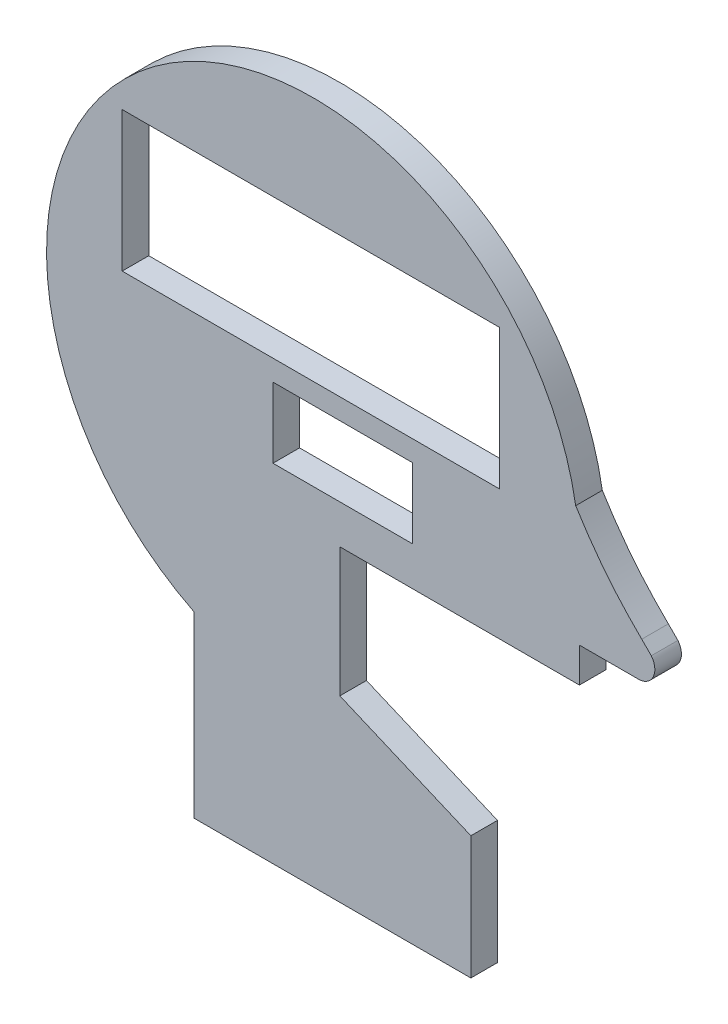
ISO-10303-21;
HEADER;
FILE_DESCRIPTION(('STEP AP214'),'2;1');
FILE_NAME('part.step','',(''),(''),'','','');
FILE_SCHEMA(('AUTOMOTIVE_DESIGN { 1 0 10303 214 1 1 1 1 }'));
ENDSEC;
DATA;
#1=APPLICATION_CONTEXT('core data for automotive mechanical design processes');
#2=APPLICATION_PROTOCOL_DEFINITION('international standard','automotive_design',2000,#1);
#3=PRODUCT_CONTEXT('',#1,'mechanical');
#4=PRODUCT('Part','Part','',(#3));
#5=PRODUCT_RELATED_PRODUCT_CATEGORY('part','',(#4));
#6=PRODUCT_DEFINITION_FORMATION('','',#4);
#7=PRODUCT_DEFINITION_CONTEXT('part definition',#1,'design');
#8=PRODUCT_DEFINITION('design','',#6,#7);
#9=PRODUCT_DEFINITION_SHAPE('','',#8);
#10=(LENGTH_UNIT() NAMED_UNIT(*) SI_UNIT(.MILLI.,.METRE.));
#11=(NAMED_UNIT(*) PLANE_ANGLE_UNIT() SI_UNIT($,.RADIAN.));
#12=(NAMED_UNIT(*) SI_UNIT($,.STERADIAN.) SOLID_ANGLE_UNIT());
#13=UNCERTAINTY_MEASURE_WITH_UNIT(LENGTH_MEASURE(1.E-05),#10,'distance_accuracy_value','');
#14=(GEOMETRIC_REPRESENTATION_CONTEXT(3) GLOBAL_UNCERTAINTY_ASSIGNED_CONTEXT((#13)) GLOBAL_UNIT_ASSIGNED_CONTEXT((#10,
#11,#12)) REPRESENTATION_CONTEXT('',''));
#15=CARTESIAN_POINT('',(0.,0.,0.));
#16=DIRECTION('',(0.,0.,1.));
#17=DIRECTION('',(1.,0.,0.));
#18=AXIS2_PLACEMENT_3D('',#15,#16,#17);
#19=CARTESIAN_POINT('',(75.2526666653318,12.6991314866566,7.62));
#20=CARTESIAN_POINT('',(83.2682176563842,-0.404579697613995,7.62));
#21=CARTESIAN_POINT('',(94.1739478198759,-10.9638502208492,7.62));
#22=B_SPLINE_CURVE_WITH_KNOTS('',2,(#19,#20,#21),.UNSPECIFIED.,.F.,.F.,(3,3),(0.,1.),.UNSPECIFIED.);
#23=DIRECTION('',(0.,0.,-1.));
#24=VECTOR('',#23,1.);
#25=SURFACE_OF_LINEAR_EXTRUSION('',#22,#24);
#26=CARTESIAN_POINT('',(75.2526666653318,12.6991314866566,0.));
#27=CARTESIAN_POINT('',(83.2682176563842,-0.404579697613995,0.));
#28=CARTESIAN_POINT('',(94.1739478198759,-10.9638502208492,0.));
#29=B_SPLINE_CURVE_WITH_KNOTS('',2,(#26,#27,#28),.UNSPECIFIED.,.F.,.F.,(3,3),(0.,1.),.UNSPECIFIED.);
#30=CARTESIAN_POINT('',(75.2526666653318,12.6991314866566,0.));
#31=VERTEX_POINT('',#30);
#32=CARTESIAN_POINT('',(94.1739478198759,-10.9638502208492,0.));
#33=VERTEX_POINT('',#32);
#34=EDGE_CURVE('E207',#31,#33,#29,.T.);
#35=ORIENTED_EDGE('',*,*,#34,.F.);
#36=DIRECTION('',(0.,0.,-1.));
#37=VECTOR('',#36,1.);
#38=CARTESIAN_POINT('',(75.2526666653318,12.6991314866566,7.62));
#39=LINE('',#38,#37);
#40=CARTESIAN_POINT('',(75.2526666653318,12.6991314866566,7.62));
#41=VERTEX_POINT('',#40);
#42=EDGE_CURVE('E11',#41,#31,#39,.T.);
#43=ORIENTED_EDGE('',*,*,#42,.F.);
#44=CARTESIAN_POINT('',(94.1739478198759,-10.9638502208492,7.62));
#45=VERTEX_POINT('',#44);
#46=EDGE_CURVE('E239',#41,#45,#22,.T.);
#47=ORIENTED_EDGE('',*,*,#46,.T.);
#48=DIRECTION('',(0.,0.,-1.));
#49=VECTOR('',#48,1.);
#50=CARTESIAN_POINT('',(94.1739478198759,-10.9638502208492,7.62));
#51=LINE('',#50,#49);
#52=EDGE_CURVE('E275',#45,#33,#51,.T.);
#53=ORIENTED_EDGE('',*,*,#52,.T.);
#54=EDGE_LOOP('',(#35,#43,#47,#53));
#55=FACE_BOUND('',#54,.T.);
#56=ADVANCED_FACE('F34',(#55),#25,.T.);
#57=CARTESIAN_POINT('',(0.,0.,7.62));
#58=DIRECTION('',(0.,0.,-1.));
#59=DIRECTION('',(-1.,0.,0.));
#60=AXIS2_PLACEMENT_3D('',#57,#58,#59);
#61=CYLINDRICAL_SURFACE('',#60,76.316654674841);
#62=CARTESIAN_POINT('',(0.,0.,0.));
#63=DIRECTION('',(0.,0.,1.));
#64=DIRECTION('',(1.,0.,0.));
#65=AXIS2_PLACEMENT_3D('',#62,#63,#64);
#66=CIRCLE('',#65,76.316654674841);
#67=CARTESIAN_POINT('',(-34.1298455336643,-68.2596910673286,0.));
#68=VERTEX_POINT('',#67);
#69=EDGE_CURVE('E280',#31,#68,#66,.T.);
#70=ORIENTED_EDGE('',*,*,#69,.T.);
#71=DIRECTION('',(0.,0.,-1.));
#72=VECTOR('',#71,1.);
#73=CARTESIAN_POINT('',(-34.1298455336643,-68.2596910673286,7.62));
#74=LINE('',#73,#72);
#75=CARTESIAN_POINT('',(-34.1298455336643,-68.2596910673286,7.62));
#76=VERTEX_POINT('',#75);
#77=EDGE_CURVE('E42',#76,#68,#74,.T.);
#78=ORIENTED_EDGE('',*,*,#77,.F.);
#79=CARTESIAN_POINT('',(0.,0.,7.62));
#80=DIRECTION('',(0.,0.,1.));
#81=DIRECTION('',(1.,0.,0.));
#82=AXIS2_PLACEMENT_3D('',#79,#80,#81);
#83=CIRCLE('',#82,76.316654674841);
#84=EDGE_CURVE('E245',#41,#76,#83,.T.);
#85=ORIENTED_EDGE('',*,*,#84,.F.);
#86=ORIENTED_EDGE('',*,*,#42,.T.);
#87=EDGE_LOOP('',(#70,#78,#85,#86));
#88=FACE_BOUND('',#87,.T.);
#89=ADVANCED_FACE('F361',(#88),#61,.T.);
#90=CARTESIAN_POINT('',(-34.1298455336643,0.,7.62));
#91=DIRECTION('',(1.,0.,0.));
#92=DIRECTION('',(0.,0.,-1.));
#93=AXIS2_PLACEMENT_3D('',#90,#91,#92);
#94=PLANE('',#93);
#95=DIRECTION('',(0.,-1.,0.));
#96=VECTOR('',#95,1.);
#97=CARTESIAN_POINT('',(-34.1298455336643,0.,0.));
#98=LINE('',#97,#96);
#99=CARTESIAN_POINT('',(-34.1298455336643,-119.480702222455,0.));
#100=VERTEX_POINT('',#99);
#101=EDGE_CURVE('E285',#68,#100,#98,.T.);
#102=ORIENTED_EDGE('',*,*,#101,.T.);
#103=DIRECTION('',(0.,0.,-1.));
#104=VECTOR('',#103,1.);
#105=CARTESIAN_POINT('',(-34.1298455336643,-119.480702222455,7.62));
#106=LINE('',#105,#104);
#107=CARTESIAN_POINT('',(-34.1298455336643,-119.480702222455,7.62));
#108=VERTEX_POINT('',#107);
#109=EDGE_CURVE('E330',#108,#100,#106,.T.);
#110=ORIENTED_EDGE('',*,*,#109,.F.);
#111=DIRECTION('',(0.,-1.,0.));
#112=VECTOR('',#111,1.);
#113=CARTESIAN_POINT('',(-34.1298455336643,0.,7.62));
#114=LINE('',#113,#112);
#115=EDGE_CURVE('E251',#76,#108,#114,.T.);
#116=ORIENTED_EDGE('',*,*,#115,.F.);
#117=ORIENTED_EDGE('',*,*,#77,.T.);
#118=EDGE_LOOP('',(#102,#110,#116,#117));
#119=FACE_BOUND('',#118,.T.);
#120=ADVANCED_FACE('F337',(#119),#94,.F.);
#121=CARTESIAN_POINT('',(0.,-119.480702222455,7.62));
#122=DIRECTION('',(0.,1.,0.));
#123=DIRECTION('',(0.,0.,1.));
#124=AXIS2_PLACEMENT_3D('',#121,#122,#123);
#125=PLANE('',#124);
#126=DIRECTION('',(1.,0.,0.));
#127=VECTOR('',#126,1.);
#128=CARTESIAN_POINT('',(0.,-119.480702222455,0.));
#129=LINE('',#128,#127);
#130=CARTESIAN_POINT('',(45.2246180142055,-119.480702222455,0.));
#131=VERTEX_POINT('',#130);
#132=EDGE_CURVE('E287',#100,#131,#129,.T.);
#133=ORIENTED_EDGE('',*,*,#132,.T.);
#134=DIRECTION('',(0.,0.,-1.));
#135=VECTOR('',#134,1.);
#136=CARTESIAN_POINT('',(45.2246180142055,-119.480702222455,7.62));
#137=LINE('',#136,#135);
#138=CARTESIAN_POINT('',(45.2246180142055,-119.480702222455,7.62));
#139=VERTEX_POINT('',#138);
#140=EDGE_CURVE('E327',#139,#131,#137,.T.);
#141=ORIENTED_EDGE('',*,*,#140,.F.);
#142=DIRECTION('',(1.,0.,0.));
#143=VECTOR('',#142,1.);
#144=CARTESIAN_POINT('',(0.,-119.480702222455,7.62));
#145=LINE('',#144,#143);
#146=EDGE_CURVE('E253',#108,#139,#145,.T.);
#147=ORIENTED_EDGE('',*,*,#146,.F.);
#148=ORIENTED_EDGE('',*,*,#109,.T.);
#149=EDGE_LOOP('',(#133,#141,#147,#148));
#150=FACE_BOUND('',#149,.T.);
#151=ADVANCED_FACE('F349',(#150),#125,.F.);
#152=CARTESIAN_POINT('',(45.2246180142055,0.,7.62));
#153=DIRECTION('',(-1.,0.,0.));
#154=DIRECTION('',(0.,0.,1.));
#155=AXIS2_PLACEMENT_3D('',#152,#153,#154);
#156=PLANE('',#155);
#157=DIRECTION('',(0.,1.,0.));
#158=VECTOR('',#157,1.);
#159=CARTESIAN_POINT('',(45.2246180142055,0.,0.));
#160=LINE('',#159,#158);
#161=CARTESIAN_POINT('',(45.2246180142055,-84.1898175425767,0.));
#162=VERTEX_POINT('',#161);
#163=EDGE_CURVE('E289',#131,#162,#160,.T.);
#164=ORIENTED_EDGE('',*,*,#163,.T.);
#165=DIRECTION('',(0.,0.,-1.));
#166=VECTOR('',#165,1.);
#167=CARTESIAN_POINT('',(45.2246180142055,-84.1898175425767,7.62));
#168=LINE('',#167,#166);
#169=CARTESIAN_POINT('',(45.2246180142055,-84.1898175425767,7.62));
#170=VERTEX_POINT('',#169);
#171=EDGE_CURVE('E324',#170,#162,#168,.T.);
#172=ORIENTED_EDGE('',*,*,#171,.F.);
#173=DIRECTION('',(0.,1.,0.));
#174=VECTOR('',#173,1.);
#175=CARTESIAN_POINT('',(45.2246180142055,0.,7.62));
#176=LINE('',#175,#174);
#177=EDGE_CURVE('E255',#139,#170,#176,.T.);
#178=ORIENTED_EDGE('',*,*,#177,.F.);
#179=ORIENTED_EDGE('',*,*,#140,.T.);
#180=EDGE_LOOP('',(#164,#172,#178,#179));
#181=FACE_BOUND('',#180,.T.);
#182=ADVANCED_FACE('F353',(#181),#156,.F.);
#183=CARTESIAN_POINT('',(-23.3754298512414,-55.0728029684429,7.62));
#184=DIRECTION('',(-0.390708637082128,-0.920514400164075,0.));
#185=DIRECTION('',(0.920514400164075,-0.390708637082128,0.));
#186=AXIS2_PLACEMENT_3D('',#183,#184,#185);
#187=PLANE('',#186);
#188=DIRECTION('',(-0.920514400164075,0.390708637082128,0.));
#189=VECTOR('',#188,1.);
#190=CARTESIAN_POINT('',(-23.3754298512414,-55.0728029684429,0.));
#191=LINE('',#190,#189);
#192=CARTESIAN_POINT('',(7.69304224354117,-68.2596910673286,0.));
#193=VERTEX_POINT('',#192);
#194=EDGE_CURVE('E291',#162,#193,#191,.T.);
#195=ORIENTED_EDGE('',*,*,#194,.T.);
#196=DIRECTION('',(0.,0.,-1.));
#197=VECTOR('',#196,1.);
#198=CARTESIAN_POINT('',(7.69304224354117,-68.2596910673286,7.62));
#199=LINE('',#198,#197);
#200=CARTESIAN_POINT('',(7.69304224354117,-68.2596910673286,7.62));
#201=VERTEX_POINT('',#200);
#202=EDGE_CURVE('E321',#201,#193,#199,.T.);
#203=ORIENTED_EDGE('',*,*,#202,.F.);
#204=DIRECTION('',(-0.920514400164075,0.390708637082128,0.));
#205=VECTOR('',#204,1.);
#206=CARTESIAN_POINT('',(-23.3754298512414,-55.0728029684429,7.62));
#207=LINE('',#206,#205);
#208=EDGE_CURVE('E257',#170,#201,#207,.T.);
#209=ORIENTED_EDGE('',*,*,#208,.F.);
#210=ORIENTED_EDGE('',*,*,#171,.T.);
#211=EDGE_LOOP('',(#195,#203,#209,#210));
#212=FACE_BOUND('',#211,.T.);
#213=ADVANCED_FACE('F389',(#212),#187,.F.);
#214=CARTESIAN_POINT('',(7.69304224354117,0.,7.62));
#215=DIRECTION('',(-1.,0.,0.));
#216=DIRECTION('',(0.,0.,1.));
#217=AXIS2_PLACEMENT_3D('',#214,#215,#216);
#218=PLANE('',#217);
#219=DIRECTION('',(0.,1.,0.));
#220=VECTOR('',#219,1.);
#221=CARTESIAN_POINT('',(7.69304224354117,0.,0.));
#222=LINE('',#221,#220);
#223=CARTESIAN_POINT('',(7.69304224354117,-31.2735502572566,0.));
#224=VERTEX_POINT('',#223);
#225=EDGE_CURVE('E293',#193,#224,#222,.T.);
#226=ORIENTED_EDGE('',*,*,#225,.T.);
#227=DIRECTION('',(0.,0.,-1.));
#228=VECTOR('',#227,1.);
#229=CARTESIAN_POINT('',(7.69304224354117,-31.2735502572566,7.62));
#230=LINE('',#229,#228);
#231=CARTESIAN_POINT('',(7.69304224354117,-31.2735502572566,7.62));
#232=VERTEX_POINT('',#231);
#233=EDGE_CURVE('E319',#232,#224,#230,.T.);
#234=ORIENTED_EDGE('',*,*,#233,.F.);
#235=DIRECTION('',(0.,1.,0.));
#236=VECTOR('',#235,1.);
#237=CARTESIAN_POINT('',(7.69304224354117,0.,7.62));
#238=LINE('',#237,#236);
#239=EDGE_CURVE('E259',#201,#232,#238,.T.);
#240=ORIENTED_EDGE('',*,*,#239,.F.);
#241=ORIENTED_EDGE('',*,*,#202,.T.);
#242=EDGE_LOOP('',(#226,#234,#240,#241));
#243=FACE_BOUND('',#242,.T.);
#244=ADVANCED_FACE('F387',(#243),#218,.F.);
#245=CARTESIAN_POINT('',(0.,-31.2735502572566,7.62));
#246=DIRECTION('',(0.,-1.,0.));
#247=DIRECTION('',(0.,0.,-1.));
#248=AXIS2_PLACEMENT_3D('',#245,#246,#247);
#249=PLANE('',#248);
#250=DIRECTION('',(-1.,0.,0.));
#251=VECTOR('',#250,1.);
#252=CARTESIAN_POINT('',(0.,-31.2735502572566,0.));
#253=LINE('',#252,#251);
#254=CARTESIAN_POINT('',(76.316654674841,-31.2735502572566,0.));
#255=VERTEX_POINT('',#254);
#256=EDGE_CURVE('E296',#255,#224,#253,.T.);
#257=ORIENTED_EDGE('',*,*,#256,.F.);
#258=DIRECTION('',(0.,0.,-1.));
#259=VECTOR('',#258,1.);
#260=CARTESIAN_POINT('',(76.316654674841,-31.2735502572566,7.62));
#261=LINE('',#260,#259);
#262=CARTESIAN_POINT('',(76.316654674841,-31.2735502572566,7.62));
#263=VERTEX_POINT('',#262);
#264=EDGE_CURVE('E317',#263,#255,#261,.T.);
#265=ORIENTED_EDGE('',*,*,#264,.F.);
#266=DIRECTION('',(-1.,0.,0.));
#267=VECTOR('',#266,1.);
#268=CARTESIAN_POINT('',(0.,-31.2735502572566,7.62));
#269=LINE('',#268,#267);
#270=EDGE_CURVE('E261',#263,#232,#269,.T.);
#271=ORIENTED_EDGE('',*,*,#270,.T.);
#272=ORIENTED_EDGE('',*,*,#233,.T.);
#273=EDGE_LOOP('',(#257,#265,#271,#272));
#274=FACE_BOUND('',#273,.T.);
#275=ADVANCED_FACE('F382',(#274),#249,.T.);
#276=CARTESIAN_POINT('',(76.316654674841,0.,7.62));
#277=DIRECTION('',(1.,0.,0.));
#278=DIRECTION('',(0.,0.,-1.));
#279=AXIS2_PLACEMENT_3D('',#276,#277,#278);
#280=PLANE('',#279);
#281=DIRECTION('',(0.,-1.,0.));
#282=VECTOR('',#281,1.);
#283=CARTESIAN_POINT('',(76.316654674841,0.,0.));
#284=LINE('',#283,#282);
#285=CARTESIAN_POINT('',(76.316654674841,-21.3544952459778,0.));
#286=VERTEX_POINT('',#285);
#287=EDGE_CURVE('E299',#286,#255,#284,.T.);
#288=ORIENTED_EDGE('',*,*,#287,.F.);
#289=DIRECTION('',(0.,0.,-1.));
#290=VECTOR('',#289,1.);
#291=CARTESIAN_POINT('',(76.316654674841,-21.3544952459778,7.62));
#292=LINE('',#291,#290);
#293=CARTESIAN_POINT('',(76.316654674841,-21.3544952459778,7.62));
#294=VERTEX_POINT('',#293);
#295=EDGE_CURVE('E315',#294,#286,#292,.T.);
#296=ORIENTED_EDGE('',*,*,#295,.F.);
#297=DIRECTION('',(0.,-1.,0.));
#298=VECTOR('',#297,1.);
#299=CARTESIAN_POINT('',(76.316654674841,0.,7.62));
#300=LINE('',#299,#298);
#301=EDGE_CURVE('E264',#294,#263,#300,.T.);
#302=ORIENTED_EDGE('',*,*,#301,.T.);
#303=ORIENTED_EDGE('',*,*,#264,.T.);
#304=EDGE_LOOP('',(#288,#296,#302,#303));
#305=FACE_BOUND('',#304,.T.);
#306=ADVANCED_FACE('F378',(#305),#280,.T.);
#307=CARTESIAN_POINT('',(0.,-21.3544952459778,7.62));
#308=DIRECTION('',(0.,-1.,0.));
#309=DIRECTION('',(0.,0.,-1.));
#310=AXIS2_PLACEMENT_3D('',#307,#308,#309);
#311=PLANE('',#310);
#312=DIRECTION('',(-1.,0.,0.));
#313=VECTOR('',#312,1.);
#314=CARTESIAN_POINT('',(0.,-21.3544952459778,0.));
#315=LINE('',#314,#313);
#316=CARTESIAN_POINT('',(93.1975199335101,-21.3544952459778,0.));
#317=VERTEX_POINT('',#316);
#318=EDGE_CURVE('E302',#317,#286,#315,.T.);
#319=ORIENTED_EDGE('',*,*,#318,.F.);
#320=DIRECTION('',(0.,0.,-1.));
#321=VECTOR('',#320,1.);
#322=CARTESIAN_POINT('',(93.1975199335101,-21.3544952459778,7.62));
#323=LINE('',#322,#321);
#324=CARTESIAN_POINT('',(93.1975199335101,-21.3544952459778,7.62));
#325=VERTEX_POINT('',#324);
#326=EDGE_CURVE('E313',#325,#317,#323,.T.);
#327=ORIENTED_EDGE('',*,*,#326,.F.);
#328=DIRECTION('',(-1.,0.,0.));
#329=VECTOR('',#328,1.);
#330=CARTESIAN_POINT('',(0.,-21.3544952459778,7.62));
#331=LINE('',#330,#329);
#332=EDGE_CURVE('E267',#325,#294,#331,.T.);
#333=ORIENTED_EDGE('',*,*,#332,.T.);
#334=ORIENTED_EDGE('',*,*,#295,.T.);
#335=EDGE_LOOP('',(#319,#327,#333,#334));
#336=FACE_BOUND('',#335,.T.);
#337=ADVANCED_FACE('F373',(#336),#311,.T.);
#338=CARTESIAN_POINT('',(93.1975199335101,-16.6271319617705,7.62));
#339=DIRECTION('',(0.,0.,-1.));
#340=DIRECTION('',(-1.,0.,0.));
#341=AXIS2_PLACEMENT_3D('',#338,#339,#340);
#342=CYLINDRICAL_SURFACE('',#341,4.72736328420733);
#343=CARTESIAN_POINT('',(93.1975199335101,-16.6271319617705,0.));
#344=DIRECTION('',(0.,0.,1.));
#345=DIRECTION('',(1.,0.,0.));
#346=AXIS2_PLACEMENT_3D('',#343,#344,#345);
#347=CIRCLE('',#346,4.72736328420733);
#348=CARTESIAN_POINT('',(96.9079459016999,-13.6978483026732,0.));
#349=VERTEX_POINT('',#348);
#350=EDGE_CURVE('E305',#317,#349,#347,.T.);
#351=ORIENTED_EDGE('',*,*,#350,.T.);
#352=DIRECTION('',(0.,0.,-1.));
#353=VECTOR('',#352,1.);
#354=CARTESIAN_POINT('',(96.9079459016999,-13.6978483026732,7.62));
#355=LINE('',#354,#353);
#356=CARTESIAN_POINT('',(96.9079459016999,-13.6978483026732,7.62));
#357=VERTEX_POINT('',#356);
#358=EDGE_CURVE('E311',#357,#349,#355,.T.);
#359=ORIENTED_EDGE('',*,*,#358,.F.);
#360=CARTESIAN_POINT('',(93.1975199335101,-16.6271319617705,7.62));
#361=DIRECTION('',(0.,0.,1.));
#362=DIRECTION('',(1.,0.,0.));
#363=AXIS2_PLACEMENT_3D('',#360,#361,#362);
#364=CIRCLE('',#363,4.72736328420733);
#365=EDGE_CURVE('E270',#325,#357,#364,.T.);
#366=ORIENTED_EDGE('',*,*,#365,.F.);
#367=ORIENTED_EDGE('',*,*,#326,.T.);
#368=EDGE_LOOP('',(#351,#359,#366,#367));
#369=FACE_BOUND('',#368,.T.);
#370=ADVANCED_FACE('F370',(#369),#342,.T.);
#371=CARTESIAN_POINT('',(41.6050487995133,41.6050487995133,7.62));
#372=DIRECTION('',(0.707106781186548,0.707106781186548,0.));
#373=DIRECTION('',(-0.707106781186548,0.707106781186548,0.));
#374=AXIS2_PLACEMENT_3D('',#371,#372,#373);
#375=PLANE('',#374);
#376=DIRECTION('',(0.707106781186548,-0.707106781186548,0.));
#377=VECTOR('',#376,1.);
#378=CARTESIAN_POINT('',(41.6050487995133,41.6050487995133,0.));
#379=LINE('',#378,#377);
#380=EDGE_CURVE('E246',#33,#349,#379,.T.);
#381=ORIENTED_EDGE('',*,*,#380,.F.);
#382=ORIENTED_EDGE('',*,*,#52,.F.);
#383=DIRECTION('',(0.707106781186548,-0.707106781186548,0.));
#384=VECTOR('',#383,1.);
#385=CARTESIAN_POINT('',(41.6050487995133,41.6050487995133,7.62));
#386=LINE('',#385,#384);
#387=EDGE_CURVE('E272',#45,#357,#386,.T.);
#388=ORIENTED_EDGE('',*,*,#387,.T.);
#389=ORIENTED_EDGE('',*,*,#358,.T.);
#390=EDGE_LOOP('',(#381,#382,#388,#389));
#391=FACE_BOUND('',#390,.T.);
#392=ADVANCED_FACE('F366',(#391),#375,.T.);
#393=CARTESIAN_POINT('',(0.,0.,7.62));
#394=DIRECTION('',(0.,0.,1.));
#395=DIRECTION('',(1.,0.,0.));
#396=AXIS2_PLACEMENT_3D('',#393,#394,#395);
#397=PLANE('',#396);
#398=DIRECTION('',(0.,-1.,0.));
#399=VECTOR('',#398,1.);
#400=CARTESIAN_POINT('',(-54.6531701874926,46.01567685026,7.62));
#401=LINE('',#400,#399);
#402=CARTESIAN_POINT('',(-54.6531701874926,46.01567685026,7.62));
#403=VERTEX_POINT('',#402);
#404=CARTESIAN_POINT('',(-54.6531701874926,5.93748763468227,7.62));
#405=VERTEX_POINT('',#404);
#406=EDGE_CURVE('E49',#403,#405,#401,.T.);
#407=ORIENTED_EDGE('',*,*,#406,.F.);
#408=DIRECTION('',(-1.,0.,0.));
#409=VECTOR('',#408,1.);
#410=CARTESIAN_POINT('',(-54.6531701874926,46.01567685026,7.62));
#411=LINE('',#410,#409);
#412=CARTESIAN_POINT('',(53.4572596589271,46.01567685026,7.62));
#413=VERTEX_POINT('',#412);
#414=EDGE_CURVE('E191',#413,#403,#411,.T.);
#415=ORIENTED_EDGE('',*,*,#414,.F.);
#416=DIRECTION('',(0.,1.,0.));
#417=VECTOR('',#416,1.);
#418=CARTESIAN_POINT('',(53.4572596589271,46.01567685026,7.62));
#419=LINE('',#418,#417);
#420=CARTESIAN_POINT('',(53.4572596589271,5.93748763468227,7.62));
#421=VERTEX_POINT('',#420);
#422=EDGE_CURVE('E194',#421,#413,#419,.T.);
#423=ORIENTED_EDGE('',*,*,#422,.F.);
#424=DIRECTION('',(1.,0.,0.));
#425=VECTOR('',#424,1.);
#426=CARTESIAN_POINT('',(-54.6531701874926,5.93748763468227,7.62));
#427=LINE('',#426,#425);
#428=EDGE_CURVE('E200',#405,#421,#427,.T.);
#429=ORIENTED_EDGE('',*,*,#428,.F.);
#430=EDGE_LOOP('',(#407,#415,#423,#429));
#431=FACE_BOUND('',#430,.T.);
#432=DIRECTION('',(0.,-1.,0.));
#433=VECTOR('',#432,1.);
#434=CARTESIAN_POINT('',(-11.4651088470623,0.,7.62));
#435=LINE('',#434,#433);
#436=CARTESIAN_POINT('',(-11.4651088470623,0.,7.62));
#437=VERTEX_POINT('',#436);
#438=CARTESIAN_POINT('',(-11.4651088470623,-20.131358600274,7.62));
#439=VERTEX_POINT('',#438);
#440=EDGE_CURVE('E57',#437,#439,#435,.T.);
#441=ORIENTED_EDGE('',*,*,#440,.F.);
#442=DIRECTION('',(-1.,0.,0.));
#443=VECTOR('',#442,1.);
#444=CARTESIAN_POINT('',(-11.4651088470623,0.,7.62));
#445=LINE('',#444,#443);
#446=CARTESIAN_POINT('',(28.4820147550917,0.,7.62));
#447=VERTEX_POINT('',#446);
#448=EDGE_CURVE('E215',#447,#437,#445,.T.);
#449=ORIENTED_EDGE('',*,*,#448,.F.);
#450=DIRECTION('',(0.,1.,0.));
#451=VECTOR('',#450,1.);
#452=CARTESIAN_POINT('',(28.4820147550917,0.,7.62));
#453=LINE('',#452,#451);
#454=CARTESIAN_POINT('',(28.4820147550917,-20.131358600274,7.62));
#455=VERTEX_POINT('',#454);
#456=EDGE_CURVE('E229',#455,#447,#453,.T.);
#457=ORIENTED_EDGE('',*,*,#456,.F.);
#458=DIRECTION('',(1.,0.,0.));
#459=VECTOR('',#458,1.);
#460=CARTESIAN_POINT('',(-11.4651088470623,-20.131358600274,7.62));
#461=LINE('',#460,#459);
#462=EDGE_CURVE('E226',#439,#455,#461,.T.);
#463=ORIENTED_EDGE('',*,*,#462,.F.);
#464=EDGE_LOOP('',(#441,#449,#457,#463));
#465=FACE_BOUND('',#464,.T.);
#466=ORIENTED_EDGE('',*,*,#46,.F.);
#467=ORIENTED_EDGE('',*,*,#84,.T.);
#468=ORIENTED_EDGE('',*,*,#115,.T.);
#469=ORIENTED_EDGE('',*,*,#146,.T.);
#470=ORIENTED_EDGE('',*,*,#177,.T.);
#471=ORIENTED_EDGE('',*,*,#208,.T.);
#472=ORIENTED_EDGE('',*,*,#239,.T.);
#473=ORIENTED_EDGE('',*,*,#270,.F.);
#474=ORIENTED_EDGE('',*,*,#301,.F.);
#475=ORIENTED_EDGE('',*,*,#332,.F.);
#476=ORIENTED_EDGE('',*,*,#365,.T.);
#477=ORIENTED_EDGE('',*,*,#387,.F.);
#478=EDGE_LOOP('',(#466,#467,#468,#469,#470,#471,#472,#473,#474,#475,#476,#477));
#479=FACE_BOUND('',#478,.T.);
#480=ADVANCED_FACE('F358',(#431,#465,#479),#397,.T.);
#481=CARTESIAN_POINT('',(0.,0.,0.));
#482=DIRECTION('',(0.,0.,1.));
#483=DIRECTION('',(1.,0.,0.));
#484=AXIS2_PLACEMENT_3D('',#481,#482,#483);
#485=PLANE('',#484);
#486=DIRECTION('',(-1.,0.,0.));
#487=VECTOR('',#486,1.);
#488=CARTESIAN_POINT('',(-54.6531701874926,46.01567685026,0.));
#489=LINE('',#488,#487);
#490=CARTESIAN_POINT('',(53.4572596589271,46.01567685026,0.));
#491=VERTEX_POINT('',#490);
#492=CARTESIAN_POINT('',(-54.6531701874926,46.01567685026,0.));
#493=VERTEX_POINT('',#492);
#494=EDGE_CURVE('E178',#491,#493,#489,.T.);
#495=ORIENTED_EDGE('',*,*,#494,.T.);
#496=DIRECTION('',(0.,-1.,0.));
#497=VECTOR('',#496,1.);
#498=CARTESIAN_POINT('',(-54.6531701874926,46.01567685026,0.));
#499=LINE('',#498,#497);
#500=CARTESIAN_POINT('',(-54.6531701874926,5.93748763468227,0.));
#501=VERTEX_POINT('',#500);
#502=EDGE_CURVE('E172',#493,#501,#499,.T.);
#503=ORIENTED_EDGE('',*,*,#502,.T.);
#504=DIRECTION('',(1.,0.,0.));
#505=VECTOR('',#504,1.);
#506=CARTESIAN_POINT('',(-54.6531701874926,5.93748763468227,0.));
#507=LINE('',#506,#505);
#508=CARTESIAN_POINT('',(53.4572596589271,5.93748763468227,0.));
#509=VERTEX_POINT('',#508);
#510=EDGE_CURVE('E182',#501,#509,#507,.T.);
#511=ORIENTED_EDGE('',*,*,#510,.T.);
#512=DIRECTION('',(0.,1.,0.));
#513=VECTOR('',#512,1.);
#514=CARTESIAN_POINT('',(53.4572596589271,46.01567685026,0.));
#515=LINE('',#514,#513);
#516=EDGE_CURVE('E186',#509,#491,#515,.T.);
#517=ORIENTED_EDGE('',*,*,#516,.T.);
#518=EDGE_LOOP('',(#495,#503,#511,#517));
#519=FACE_BOUND('',#518,.T.);
#520=DIRECTION('',(-1.,0.,0.));
#521=VECTOR('',#520,1.);
#522=CARTESIAN_POINT('',(-11.4651088470623,0.,0.));
#523=LINE('',#522,#521);
#524=CARTESIAN_POINT('',(28.4820147550917,0.,0.));
#525=VERTEX_POINT('',#524);
#526=CARTESIAN_POINT('',(-11.4651088470623,0.,0.));
#527=VERTEX_POINT('',#526);
#528=EDGE_CURVE('E221',#525,#527,#523,.T.);
#529=ORIENTED_EDGE('',*,*,#528,.T.);
#530=DIRECTION('',(0.,-1.,0.));
#531=VECTOR('',#530,1.);
#532=CARTESIAN_POINT('',(-11.4651088470623,0.,0.));
#533=LINE('',#532,#531);
#534=CARTESIAN_POINT('',(-11.4651088470623,-20.131358600274,0.));
#535=VERTEX_POINT('',#534);
#536=EDGE_CURVE('E211',#527,#535,#533,.T.);
#537=ORIENTED_EDGE('',*,*,#536,.T.);
#538=DIRECTION('',(1.,0.,0.));
#539=VECTOR('',#538,1.);
#540=CARTESIAN_POINT('',(-11.4651088470623,-20.131358600274,0.));
#541=LINE('',#540,#539);
#542=CARTESIAN_POINT('',(28.4820147550917,-20.131358600274,0.));
#543=VERTEX_POINT('',#542);
#544=EDGE_CURVE('E214',#535,#543,#541,.T.);
#545=ORIENTED_EDGE('',*,*,#544,.T.);
#546=DIRECTION('',(0.,1.,0.));
#547=VECTOR('',#546,1.);
#548=CARTESIAN_POINT('',(28.4820147550917,0.,0.));
#549=LINE('',#548,#547);
#550=EDGE_CURVE('E218',#543,#525,#549,.T.);
#551=ORIENTED_EDGE('',*,*,#550,.T.);
#552=EDGE_LOOP('',(#529,#537,#545,#551));
#553=FACE_BOUND('',#552,.T.);
#554=ORIENTED_EDGE('',*,*,#34,.T.);
#555=ORIENTED_EDGE('',*,*,#380,.T.);
#556=ORIENTED_EDGE('',*,*,#350,.F.);
#557=ORIENTED_EDGE('',*,*,#318,.T.);
#558=ORIENTED_EDGE('',*,*,#287,.T.);
#559=ORIENTED_EDGE('',*,*,#256,.T.);
#560=ORIENTED_EDGE('',*,*,#225,.F.);
#561=ORIENTED_EDGE('',*,*,#194,.F.);
#562=ORIENTED_EDGE('',*,*,#163,.F.);
#563=ORIENTED_EDGE('',*,*,#132,.F.);
#564=ORIENTED_EDGE('',*,*,#101,.F.);
#565=ORIENTED_EDGE('',*,*,#69,.F.);
#566=EDGE_LOOP('',(#554,#555,#556,#557,#558,#559,#560,#561,#562,#563,#564,#565));
#567=FACE_BOUND('',#566,.T.);
#568=ADVANCED_FACE('F188',(#519,#553,#567),#485,.F.);
#569=CARTESIAN_POINT('',(-11.4651088470623,0.,0.));
#570=DIRECTION('',(-1.,0.,0.));
#571=DIRECTION('',(0.,0.,1.));
#572=AXIS2_PLACEMENT_3D('',#569,#570,#571);
#573=PLANE('',#572);
#574=ORIENTED_EDGE('',*,*,#440,.T.);
#575=DIRECTION('',(0.,0.,1.));
#576=VECTOR('',#575,1.);
#577=CARTESIAN_POINT('',(-11.4651088470623,-20.131358600274,0.));
#578=LINE('',#577,#576);
#579=EDGE_CURVE('E224',#535,#439,#578,.T.);
#580=ORIENTED_EDGE('',*,*,#579,.F.);
#581=ORIENTED_EDGE('',*,*,#536,.F.);
#582=DIRECTION('',(0.,0.,1.));
#583=VECTOR('',#582,1.);
#584=CARTESIAN_POINT('',(-11.4651088470623,0.,0.));
#585=LINE('',#584,#583);
#586=EDGE_CURVE('E201',#527,#437,#585,.T.);
#587=ORIENTED_EDGE('',*,*,#586,.T.);
#588=EDGE_LOOP('',(#574,#580,#581,#587));
#589=FACE_BOUND('',#588,.T.);
#590=ADVANCED_FACE('F484',(#589),#573,.F.);
#591=CARTESIAN_POINT('',(-11.4651088470623,0.,0.));
#592=DIRECTION('',(0.,1.,0.));
#593=DIRECTION('',(0.,0.,1.));
#594=AXIS2_PLACEMENT_3D('',#591,#592,#593);
#595=PLANE('',#594);
#596=ORIENTED_EDGE('',*,*,#448,.T.);
#597=ORIENTED_EDGE('',*,*,#586,.F.);
#598=ORIENTED_EDGE('',*,*,#528,.F.);
#599=DIRECTION('',(0.,0.,1.));
#600=VECTOR('',#599,1.);
#601=CARTESIAN_POINT('',(28.4820147550917,0.,0.));
#602=LINE('',#601,#600);
#603=EDGE_CURVE('E235',#525,#447,#602,.T.);
#604=ORIENTED_EDGE('',*,*,#603,.T.);
#605=EDGE_LOOP('',(#596,#597,#598,#604));
#606=FACE_BOUND('',#605,.T.);
#607=ADVANCED_FACE('F493',(#606),#595,.F.);
#608=CARTESIAN_POINT('',(28.4820147550917,0.,0.));
#609=DIRECTION('',(1.,0.,0.));
#610=DIRECTION('',(0.,0.,-1.));
#611=AXIS2_PLACEMENT_3D('',#608,#609,#610);
#612=PLANE('',#611);
#613=ORIENTED_EDGE('',*,*,#456,.T.);
#614=ORIENTED_EDGE('',*,*,#603,.F.);
#615=ORIENTED_EDGE('',*,*,#550,.F.);
#616=DIRECTION('',(0.,0.,1.));
#617=VECTOR('',#616,1.);
#618=CARTESIAN_POINT('',(28.4820147550917,-20.131358600274,0.));
#619=LINE('',#618,#617);
#620=EDGE_CURVE('E237',#543,#455,#619,.T.);
#621=ORIENTED_EDGE('',*,*,#620,.T.);
#622=EDGE_LOOP('',(#613,#614,#615,#621));
#623=FACE_BOUND('',#622,.T.);
#624=ADVANCED_FACE('F502',(#623),#612,.F.);
#625=CARTESIAN_POINT('',(-11.4651088470623,-20.131358600274,0.));
#626=DIRECTION('',(0.,-1.,0.));
#627=DIRECTION('',(0.,0.,-1.));
#628=AXIS2_PLACEMENT_3D('',#625,#626,#627);
#629=PLANE('',#628);
#630=ORIENTED_EDGE('',*,*,#462,.T.);
#631=ORIENTED_EDGE('',*,*,#620,.F.);
#632=ORIENTED_EDGE('',*,*,#544,.F.);
#633=ORIENTED_EDGE('',*,*,#579,.T.);
#634=EDGE_LOOP('',(#630,#631,#632,#633));
#635=FACE_BOUND('',#634,.T.);
#636=ADVANCED_FACE('F512',(#635),#629,.F.);
#637=CARTESIAN_POINT('',(-54.6531701874926,46.01567685026,0.));
#638=DIRECTION('',(-1.,0.,0.));
#639=DIRECTION('',(0.,0.,1.));
#640=AXIS2_PLACEMENT_3D('',#637,#638,#639);
#641=PLANE('',#640);
#642=ORIENTED_EDGE('',*,*,#406,.T.);
#643=DIRECTION('',(0.,0.,1.));
#644=VECTOR('',#643,1.);
#645=CARTESIAN_POINT('',(-54.6531701874926,5.93748763468227,0.));
#646=LINE('',#645,#644);
#647=EDGE_CURVE('E168',#501,#405,#646,.T.);
#648=ORIENTED_EDGE('',*,*,#647,.F.);
#649=ORIENTED_EDGE('',*,*,#502,.F.);
#650=DIRECTION('',(0.,0.,1.));
#651=VECTOR('',#650,1.);
#652=CARTESIAN_POINT('',(-54.6531701874926,46.01567685026,0.));
#653=LINE('',#652,#651);
#654=EDGE_CURVE('E205',#493,#403,#653,.T.);
#655=ORIENTED_EDGE('',*,*,#654,.T.);
#656=EDGE_LOOP('',(#642,#648,#649,#655));
#657=FACE_BOUND('',#656,.T.);
#658=ADVANCED_FACE('F170',(#657),#641,.F.);
#659=CARTESIAN_POINT('',(-54.6531701874926,46.01567685026,0.));
#660=DIRECTION('',(0.,1.,0.));
#661=DIRECTION('',(0.,0.,1.));
#662=AXIS2_PLACEMENT_3D('',#659,#660,#661);
#663=PLANE('',#662);
#664=ORIENTED_EDGE('',*,*,#414,.T.);
#665=ORIENTED_EDGE('',*,*,#654,.F.);
#666=ORIENTED_EDGE('',*,*,#494,.F.);
#667=DIRECTION('',(0.,0.,1.));
#668=VECTOR('',#667,1.);
#669=CARTESIAN_POINT('',(53.4572596589271,46.01567685026,0.));
#670=LINE('',#669,#668);
#671=EDGE_CURVE('E208',#491,#413,#670,.T.);
#672=ORIENTED_EDGE('',*,*,#671,.T.);
#673=EDGE_LOOP('',(#664,#665,#666,#672));
#674=FACE_BOUND('',#673,.T.);
#675=ADVANCED_FACE('F531',(#674),#663,.F.);
#676=CARTESIAN_POINT('',(53.4572596589271,46.01567685026,0.));
#677=DIRECTION('',(1.,0.,0.));
#678=DIRECTION('',(0.,0.,-1.));
#679=AXIS2_PLACEMENT_3D('',#676,#677,#678);
#680=PLANE('',#679);
#681=ORIENTED_EDGE('',*,*,#422,.T.);
#682=ORIENTED_EDGE('',*,*,#671,.F.);
#683=ORIENTED_EDGE('',*,*,#516,.F.);
#684=DIRECTION('',(0.,0.,1.));
#685=VECTOR('',#684,1.);
#686=CARTESIAN_POINT('',(53.4572596589271,5.93748763468227,0.));
#687=LINE('',#686,#685);
#688=EDGE_CURVE('E177',#509,#421,#687,.T.);
#689=ORIENTED_EDGE('',*,*,#688,.T.);
#690=EDGE_LOOP('',(#681,#682,#683,#689));
#691=FACE_BOUND('',#690,.T.);
#692=ADVANCED_FACE('F540',(#691),#680,.F.);
#693=CARTESIAN_POINT('',(-54.6531701874926,5.93748763468227,0.));
#694=DIRECTION('',(0.,-1.,0.));
#695=DIRECTION('',(0.,0.,-1.));
#696=AXIS2_PLACEMENT_3D('',#693,#694,#695);
#697=PLANE('',#696);
#698=ORIENTED_EDGE('',*,*,#428,.T.);
#699=ORIENTED_EDGE('',*,*,#688,.F.);
#700=ORIENTED_EDGE('',*,*,#510,.F.);
#701=ORIENTED_EDGE('',*,*,#647,.T.);
#702=EDGE_LOOP('',(#698,#699,#700,#701));
#703=FACE_BOUND('',#702,.T.);
#704=ADVANCED_FACE('F183',(#703),#697,.F.);
#705=CLOSED_SHELL('',(#56,#89,#120,#151,#182,#213,#244,#275,#306,#337,#370,#392,#480,#568,#590,
#607,#624,#636,#658,#675,#692,#704));
#706=MANIFOLD_SOLID_BREP('B2',#705);
#707=ADVANCED_BREP_SHAPE_REPRESENTATION('',(#18,#706),#14);
#708=SHAPE_DEFINITION_REPRESENTATION(#9,#707);
ENDSEC;
END-ISO-10303-21;
